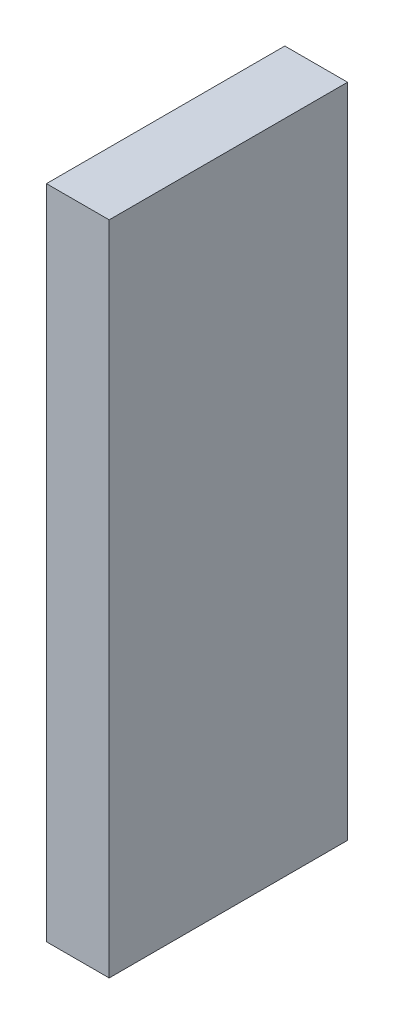
ISO-10303-21;
HEADER;
FILE_DESCRIPTION(('STEP AP214'),'2;1');
FILE_NAME('part.step','',(''),(''),'','','');
FILE_SCHEMA(('AUTOMOTIVE_DESIGN { 1 0 10303 214 1 1 1 1 }'));
ENDSEC;
DATA;
#1=APPLICATION_CONTEXT('core data for automotive mechanical design processes');
#2=APPLICATION_PROTOCOL_DEFINITION('international standard','automotive_design',2000,#1);
#3=PRODUCT_CONTEXT('',#1,'mechanical');
#4=PRODUCT('Part','Part','',(#3));
#5=PRODUCT_RELATED_PRODUCT_CATEGORY('part','',(#4));
#6=PRODUCT_DEFINITION_FORMATION('','',#4);
#7=PRODUCT_DEFINITION_CONTEXT('part definition',#1,'design');
#8=PRODUCT_DEFINITION('design','',#6,#7);
#9=PRODUCT_DEFINITION_SHAPE('','',#8);
#10=(LENGTH_UNIT() NAMED_UNIT(*) SI_UNIT(.MILLI.,.METRE.));
#11=(NAMED_UNIT(*) PLANE_ANGLE_UNIT() SI_UNIT($,.RADIAN.));
#12=(NAMED_UNIT(*) SI_UNIT($,.STERADIAN.) SOLID_ANGLE_UNIT());
#13=UNCERTAINTY_MEASURE_WITH_UNIT(LENGTH_MEASURE(1.E-05),#10,'distance_accuracy_value','');
#14=(GEOMETRIC_REPRESENTATION_CONTEXT(3) GLOBAL_UNCERTAINTY_ASSIGNED_CONTEXT((#13)) GLOBAL_UNIT_ASSIGNED_CONTEXT((#10,
#11,#12)) REPRESENTATION_CONTEXT('',''));
#15=CARTESIAN_POINT('',(0.,0.,0.));
#16=DIRECTION('',(0.,0.,1.));
#17=DIRECTION('',(1.,0.,0.));
#18=AXIS2_PLACEMENT_3D('',#15,#16,#17);
#19=CARTESIAN_POINT('',(0.,0.,57.));
#20=DIRECTION('',(1.,0.,0.));
#21=DIRECTION('',(0.,1.,0.));
#22=AXIS2_PLACEMENT_3D('',#19,#20,#21);
#23=PLANE('',#22);
#24=DIRECTION('',(0.,-1.,0.));
#25=VECTOR('',#24,1.);
#26=CARTESIAN_POINT('',(0.,0.,0.));
#27=LINE('',#26,#25);
#28=CARTESIAN_POINT('',(0.,157.,0.));
#29=VERTEX_POINT('',#28);
#30=CARTESIAN_POINT('',(0.,0.,0.));
#31=VERTEX_POINT('',#30);
#32=EDGE_CURVE('E99',#29,#31,#27,.T.);
#33=ORIENTED_EDGE('',*,*,#32,.T.);
#34=DIRECTION('',(0.,0.,-1.));
#35=VECTOR('',#34,1.);
#36=CARTESIAN_POINT('',(0.,0.,57.));
#37=LINE('',#36,#35);
#38=CARTESIAN_POINT('',(0.,0.,57.));
#39=VERTEX_POINT('',#38);
#40=EDGE_CURVE('E11',#39,#31,#37,.T.);
#41=ORIENTED_EDGE('',*,*,#40,.F.);
#42=DIRECTION('',(0.,-1.,0.));
#43=VECTOR('',#42,1.);
#44=CARTESIAN_POINT('',(0.,0.,57.));
#45=LINE('',#44,#43);
#46=CARTESIAN_POINT('',(0.,157.,57.));
#47=VERTEX_POINT('',#46);
#48=EDGE_CURVE('E87',#47,#39,#45,.T.);
#49=ORIENTED_EDGE('',*,*,#48,.F.);
#50=DIRECTION('',(0.,0.,-1.));
#51=VECTOR('',#50,1.);
#52=CARTESIAN_POINT('',(0.,157.,57.));
#53=LINE('',#52,#51);
#54=EDGE_CURVE('E95',#47,#29,#53,.T.);
#55=ORIENTED_EDGE('',*,*,#54,.T.);
#56=EDGE_LOOP('',(#33,#41,#49,#55));
#57=FACE_BOUND('',#56,.T.);
#58=ADVANCED_FACE('F36',(#57),#23,.F.);
#59=CARTESIAN_POINT('',(0.,0.,57.));
#60=DIRECTION('',(0.,1.,0.));
#61=DIRECTION('',(0.,0.,1.));
#62=AXIS2_PLACEMENT_3D('',#59,#60,#61);
#63=PLANE('',#62);
#64=DIRECTION('',(1.,0.,0.));
#65=VECTOR('',#64,1.);
#66=CARTESIAN_POINT('',(0.,0.,0.));
#67=LINE('',#66,#65);
#68=CARTESIAN_POINT('',(15.,0.,0.));
#69=VERTEX_POINT('',#68);
#70=EDGE_CURVE('E91',#31,#69,#67,.T.);
#71=ORIENTED_EDGE('',*,*,#70,.T.);
#72=DIRECTION('',(0.,0.,-1.));
#73=VECTOR('',#72,1.);
#74=CARTESIAN_POINT('',(15.,0.,57.));
#75=LINE('',#74,#73);
#76=CARTESIAN_POINT('',(15.,0.,57.));
#77=VERTEX_POINT('',#76);
#78=EDGE_CURVE('E44',#77,#69,#75,.T.);
#79=ORIENTED_EDGE('',*,*,#78,.F.);
#80=DIRECTION('',(1.,0.,0.));
#81=VECTOR('',#80,1.);
#82=CARTESIAN_POINT('',(0.,0.,57.));
#83=LINE('',#82,#81);
#84=EDGE_CURVE('E82',#39,#77,#83,.T.);
#85=ORIENTED_EDGE('',*,*,#84,.F.);
#86=ORIENTED_EDGE('',*,*,#40,.T.);
#87=EDGE_LOOP('',(#71,#79,#85,#86));
#88=FACE_BOUND('',#87,.T.);
#89=ADVANCED_FACE('F90',(#88),#63,.F.);
#90=CARTESIAN_POINT('',(15.,0.,57.));
#91=DIRECTION('',(-1.,0.,0.));
#92=DIRECTION('',(0.,-1.,0.));
#93=AXIS2_PLACEMENT_3D('',#90,#91,#92);
#94=PLANE('',#93);
#95=DIRECTION('',(0.,1.,0.));
#96=VECTOR('',#95,1.);
#97=CARTESIAN_POINT('',(15.,0.,0.));
#98=LINE('',#97,#96);
#99=CARTESIAN_POINT('',(15.,157.,0.));
#100=VERTEX_POINT('',#99);
#101=EDGE_CURVE('E69',#69,#100,#98,.T.);
#102=ORIENTED_EDGE('',*,*,#101,.T.);
#103=DIRECTION('',(0.,0.,-1.));
#104=VECTOR('',#103,1.);
#105=CARTESIAN_POINT('',(15.,157.,57.));
#106=LINE('',#105,#104);
#107=CARTESIAN_POINT('',(15.,157.,57.));
#108=VERTEX_POINT('',#107);
#109=EDGE_CURVE('E92',#108,#100,#106,.T.);
#110=ORIENTED_EDGE('',*,*,#109,.F.);
#111=DIRECTION('',(0.,1.,0.));
#112=VECTOR('',#111,1.);
#113=CARTESIAN_POINT('',(15.,0.,57.));
#114=LINE('',#113,#112);
#115=EDGE_CURVE('E85',#77,#108,#114,.T.);
#116=ORIENTED_EDGE('',*,*,#115,.F.);
#117=ORIENTED_EDGE('',*,*,#78,.T.);
#118=EDGE_LOOP('',(#102,#110,#116,#117));
#119=FACE_BOUND('',#118,.T.);
#120=ADVANCED_FACE('F93',(#119),#94,.F.);
#121=CARTESIAN_POINT('',(0.,157.,57.));
#122=DIRECTION('',(0.,-1.,0.));
#123=DIRECTION('',(0.,0.,-1.));
#124=AXIS2_PLACEMENT_3D('',#121,#122,#123);
#125=PLANE('',#124);
#126=DIRECTION('',(-1.,0.,0.));
#127=VECTOR('',#126,1.);
#128=CARTESIAN_POINT('',(0.,157.,0.));
#129=LINE('',#128,#127);
#130=EDGE_CURVE('E75',#100,#29,#129,.T.);
#131=ORIENTED_EDGE('',*,*,#130,.T.);
#132=ORIENTED_EDGE('',*,*,#54,.F.);
#133=DIRECTION('',(-1.,0.,0.));
#134=VECTOR('',#133,1.);
#135=CARTESIAN_POINT('',(0.,157.,57.));
#136=LINE('',#135,#134);
#137=EDGE_CURVE('E52',#108,#47,#136,.T.);
#138=ORIENTED_EDGE('',*,*,#137,.F.);
#139=ORIENTED_EDGE('',*,*,#109,.T.);
#140=EDGE_LOOP('',(#131,#132,#138,#139));
#141=FACE_BOUND('',#140,.T.);
#142=ADVANCED_FACE('F106',(#141),#125,.F.);
#143=CARTESIAN_POINT('',(0.,0.,57.));
#144=DIRECTION('',(0.,0.,-1.));
#145=DIRECTION('',(-1.,0.,0.));
#146=AXIS2_PLACEMENT_3D('',#143,#144,#145);
#147=PLANE('',#146);
#148=ORIENTED_EDGE('',*,*,#48,.T.);
#149=ORIENTED_EDGE('',*,*,#84,.T.);
#150=ORIENTED_EDGE('',*,*,#115,.T.);
#151=ORIENTED_EDGE('',*,*,#137,.T.);
#152=EDGE_LOOP('',(#148,#149,#150,#151));
#153=FACE_BOUND('',#152,.T.);
#154=ADVANCED_FACE('F83',(#153),#147,.F.);
#155=CARTESIAN_POINT('',(0.,0.,0.));
#156=DIRECTION('',(0.,0.,-1.));
#157=DIRECTION('',(-1.,0.,0.));
#158=AXIS2_PLACEMENT_3D('',#155,#156,#157);
#159=PLANE('',#158);
#160=ORIENTED_EDGE('',*,*,#32,.F.);
#161=ORIENTED_EDGE('',*,*,#130,.F.);
#162=ORIENTED_EDGE('',*,*,#101,.F.);
#163=ORIENTED_EDGE('',*,*,#70,.F.);
#164=EDGE_LOOP('',(#160,#161,#162,#163));
#165=FACE_BOUND('',#164,.T.);
#166=ADVANCED_FACE('F109',(#165),#159,.T.);
#167=CLOSED_SHELL('',(#58,#89,#120,#142,#154,#166));
#168=MANIFOLD_SOLID_BREP('B2',#167);
#169=ADVANCED_BREP_SHAPE_REPRESENTATION('',(#18,#168),#14);
#170=SHAPE_DEFINITION_REPRESENTATION(#9,#169);
ENDSEC;
END-ISO-10303-21;
